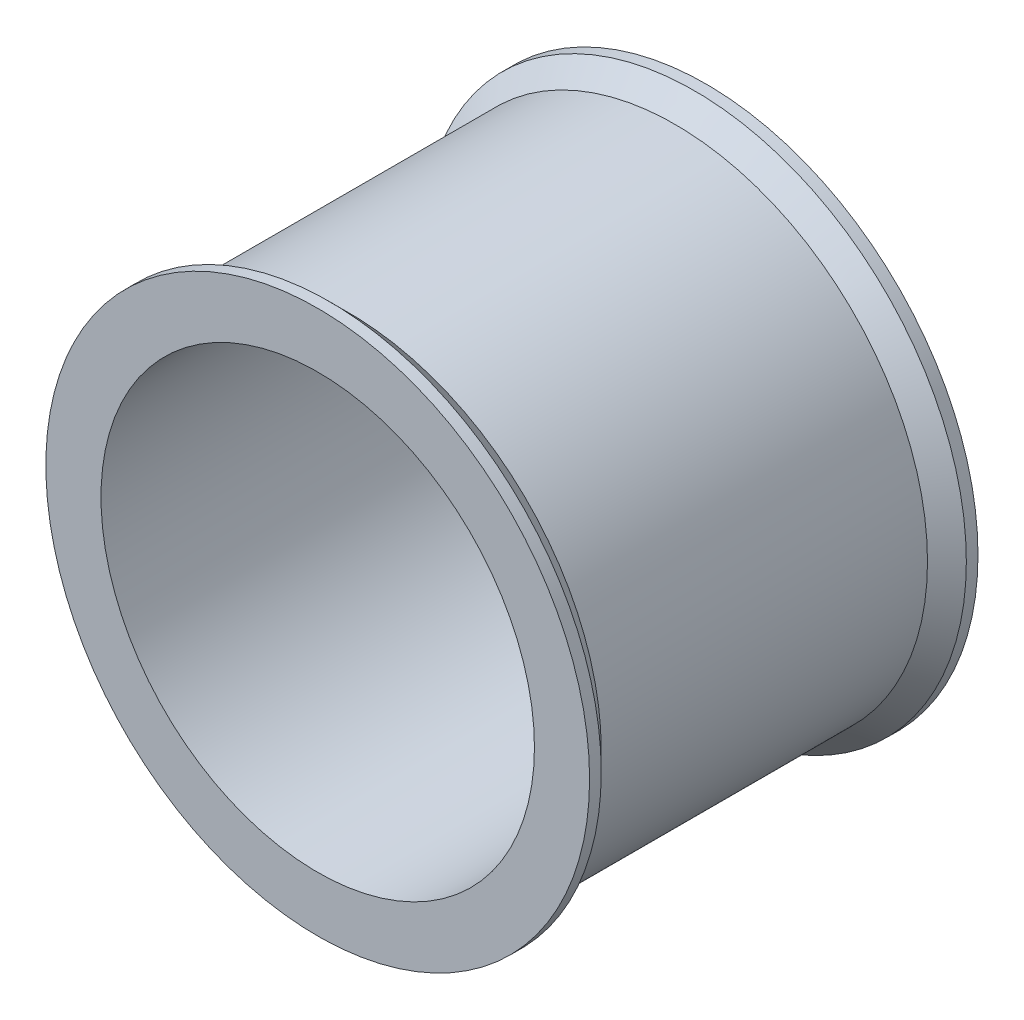
ISO-10303-21;
HEADER;
FILE_DESCRIPTION(('STEP AP214'),'2;1');
FILE_NAME('part.step','',(''),(''),'','','');
FILE_SCHEMA(('AUTOMOTIVE_DESIGN { 1 0 10303 214 1 1 1 1 }'));
ENDSEC;
DATA;
#1=APPLICATION_CONTEXT('core data for automotive mechanical design processes');
#2=APPLICATION_PROTOCOL_DEFINITION('international standard','automotive_design',2000,#1);
#3=PRODUCT_CONTEXT('',#1,'mechanical');
#4=PRODUCT('Part','Part','',(#3));
#5=PRODUCT_RELATED_PRODUCT_CATEGORY('part','',(#4));
#6=PRODUCT_DEFINITION_FORMATION('','',#4);
#7=PRODUCT_DEFINITION_CONTEXT('part definition',#1,'design');
#8=PRODUCT_DEFINITION('design','',#6,#7);
#9=PRODUCT_DEFINITION_SHAPE('','',#8);
#10=(LENGTH_UNIT() NAMED_UNIT(*) SI_UNIT(.MILLI.,.METRE.));
#11=(NAMED_UNIT(*) PLANE_ANGLE_UNIT() SI_UNIT($,.RADIAN.));
#12=(NAMED_UNIT(*) SI_UNIT($,.STERADIAN.) SOLID_ANGLE_UNIT());
#13=UNCERTAINTY_MEASURE_WITH_UNIT(LENGTH_MEASURE(1.E-05),#10,'distance_accuracy_value','');
#14=(GEOMETRIC_REPRESENTATION_CONTEXT(3) GLOBAL_UNCERTAINTY_ASSIGNED_CONTEXT((#13)) GLOBAL_UNIT_ASSIGNED_CONTEXT((#10,
#11,#12)) REPRESENTATION_CONTEXT('',''));
#15=CARTESIAN_POINT('',(0.,0.,0.));
#16=DIRECTION('',(0.,0.,1.));
#17=DIRECTION('',(1.,0.,0.));
#18=AXIS2_PLACEMENT_3D('',#15,#16,#17);
#19=CARTESIAN_POINT('',(0.,0.,5.));
#20=DIRECTION('',(0.,0.,1.));
#21=DIRECTION('',(1.,0.,0.));
#22=AXIS2_PLACEMENT_3D('',#19,#20,#21);
#23=PLANE('',#22);
#24=CARTESIAN_POINT('',(0.,0.,5.));
#25=DIRECTION('',(0.,0.,1.));
#26=DIRECTION('',(1.,0.,0.));
#27=AXIS2_PLACEMENT_3D('',#24,#25,#26);
#28=CIRCLE('',#27,5.58);
#29=CARTESIAN_POINT('',(5.58,0.,5.));
#30=VERTEX_POINT('',#29);
#31=EDGE_CURVE('E64',#30,#30,#28,.T.);
#32=ORIENTED_EDGE('',*,*,#31,.F.);
#33=EDGE_LOOP('',(#32));
#34=FACE_BOUND('',#33,.T.);
#35=CARTESIAN_POINT('',(0.,0.,5.));
#36=DIRECTION('',(0.,0.,1.));
#37=DIRECTION('',(1.,0.,0.));
#38=AXIS2_PLACEMENT_3D('',#35,#36,#37);
#39=CIRCLE('',#38,7.);
#40=CARTESIAN_POINT('',(7.,0.,5.));
#41=VERTEX_POINT('',#40);
#42=EDGE_CURVE('E76',#41,#41,#39,.T.);
#43=ORIENTED_EDGE('',*,*,#42,.T.);
#44=EDGE_LOOP('',(#43));
#45=FACE_BOUND('',#44,.T.);
#46=ADVANCED_FACE('F39',(#34,#45),#23,.T.);
#47=CARTESIAN_POINT('',(0.,0.,-5.));
#48=DIRECTION('',(0.,0.,1.));
#49=DIRECTION('',(1.,0.,0.));
#50=AXIS2_PLACEMENT_3D('',#47,#48,#49);
#51=PLANE('',#50);
#52=CARTESIAN_POINT('',(0.,0.,-5.));
#53=DIRECTION('',(0.,0.,1.));
#54=DIRECTION('',(1.,0.,0.));
#55=AXIS2_PLACEMENT_3D('',#52,#53,#54);
#56=CIRCLE('',#55,5.58);
#57=CARTESIAN_POINT('',(5.58,0.,-5.));
#58=VERTEX_POINT('',#57);
#59=EDGE_CURVE('E65',#58,#58,#56,.T.);
#60=ORIENTED_EDGE('',*,*,#59,.T.);
#61=EDGE_LOOP('',(#60));
#62=FACE_BOUND('',#61,.T.);
#63=CARTESIAN_POINT('',(0.,0.,-5.));
#64=DIRECTION('',(0.,0.,1.));
#65=DIRECTION('',(1.,0.,0.));
#66=AXIS2_PLACEMENT_3D('',#63,#64,#65);
#67=CIRCLE('',#66,7.);
#68=CARTESIAN_POINT('',(7.,0.,-5.));
#69=VERTEX_POINT('',#68);
#70=EDGE_CURVE('E69',#69,#69,#67,.T.);
#71=ORIENTED_EDGE('',*,*,#70,.F.);
#72=EDGE_LOOP('',(#71));
#73=FACE_BOUND('',#72,.T.);
#74=ADVANCED_FACE('F97',(#62,#73),#51,.F.);
#75=CARTESIAN_POINT('',(0.,0.,5.));
#76=DIRECTION('',(0.,0.,-1.));
#77=DIRECTION('',(-1.,0.,0.));
#78=AXIS2_PLACEMENT_3D('',#75,#76,#77);
#79=CYLINDRICAL_SURFACE('',#78,6.5);
#80=CARTESIAN_POINT('',(0.,0.,-4.20000000000001));
#81=DIRECTION('',(0.,0.,-1.));
#82=DIRECTION('',(-1.,0.,0.));
#83=AXIS2_PLACEMENT_3D('',#80,#81,#82);
#84=CIRCLE('',#83,6.5);
#85=CARTESIAN_POINT('',(-6.5,0.,-4.20000000000001));
#86=VERTEX_POINT('',#85);
#87=EDGE_CURVE('E10',#86,#86,#84,.F.);
#88=ORIENTED_EDGE('',*,*,#87,.T.);
#89=EDGE_LOOP('',(#88));
#90=FACE_BOUND('',#89,.T.);
#91=CARTESIAN_POINT('',(0.,0.,4.20000000000001));
#92=DIRECTION('',(0.,0.,1.));
#93=DIRECTION('',(1.,0.,0.));
#94=AXIS2_PLACEMENT_3D('',#91,#92,#93);
#95=CIRCLE('',#94,6.5);
#96=CARTESIAN_POINT('',(6.5,0.,4.20000000000001));
#97=VERTEX_POINT('',#96);
#98=EDGE_CURVE('E48',#97,#97,#95,.F.);
#99=ORIENTED_EDGE('',*,*,#98,.T.);
#100=EDGE_LOOP('',(#99));
#101=FACE_BOUND('',#100,.T.);
#102=ADVANCED_FACE('F103',(#90,#101),#79,.T.);
#103=CARTESIAN_POINT('',(0.,0.,5.));
#104=DIRECTION('',(0.,0.,-1.));
#105=DIRECTION('',(-1.,0.,0.));
#106=AXIS2_PLACEMENT_3D('',#103,#104,#105);
#107=CYLINDRICAL_SURFACE('',#106,5.58);
#108=ORIENTED_EDGE('',*,*,#31,.T.);
#109=EDGE_LOOP('',(#108));
#110=FACE_BOUND('',#109,.T.);
#111=ORIENTED_EDGE('',*,*,#59,.F.);
#112=EDGE_LOOP('',(#111));
#113=FACE_BOUND('',#112,.T.);
#114=ADVANCED_FACE('F93',(#110,#113),#107,.F.);
#115=CARTESIAN_POINT('',(0.,0.,-4.));
#116=DIRECTION('',(0.,0.,-1.));
#117=DIRECTION('',(-1.,0.,0.));
#118=AXIS2_PLACEMENT_3D('',#115,#116,#117);
#119=CYLINDRICAL_SURFACE('',#118,7.);
#120=CARTESIAN_POINT('',(0.,0.,-4.70000000000001));
#121=DIRECTION('',(0.,0.,1.));
#122=DIRECTION('',(1.,0.,0.));
#123=AXIS2_PLACEMENT_3D('',#120,#121,#122);
#124=CIRCLE('',#123,7.);
#125=CARTESIAN_POINT('',(7.,0.,-4.70000000000001));
#126=VERTEX_POINT('',#125);
#127=EDGE_CURVE('E53',#126,#126,#124,.F.);
#128=ORIENTED_EDGE('',*,*,#127,.T.);
#129=EDGE_LOOP('',(#128));
#130=FACE_BOUND('',#129,.T.);
#131=ORIENTED_EDGE('',*,*,#70,.T.);
#132=EDGE_LOOP('',(#131));
#133=FACE_BOUND('',#132,.T.);
#134=ADVANCED_FACE('F85',(#130,#133),#119,.T.);
#135=CARTESIAN_POINT('',(0.,0.,4.));
#136=DIRECTION('',(0.,0.,1.));
#137=DIRECTION('',(1.,0.,0.));
#138=AXIS2_PLACEMENT_3D('',#135,#136,#137);
#139=CYLINDRICAL_SURFACE('',#138,7.);
#140=CARTESIAN_POINT('',(0.,0.,4.70000000000001));
#141=DIRECTION('',(0.,0.,-1.));
#142=DIRECTION('',(-1.,0.,0.));
#143=AXIS2_PLACEMENT_3D('',#140,#141,#142);
#144=CIRCLE('',#143,7.);
#145=CARTESIAN_POINT('',(-7.,0.,4.70000000000001));
#146=VERTEX_POINT('',#145);
#147=EDGE_CURVE('E58',#146,#146,#144,.F.);
#148=ORIENTED_EDGE('',*,*,#147,.T.);
#149=EDGE_LOOP('',(#148));
#150=FACE_BOUND('',#149,.T.);
#151=ORIENTED_EDGE('',*,*,#42,.F.);
#152=EDGE_LOOP('',(#151));
#153=FACE_BOUND('',#152,.T.);
#154=ADVANCED_FACE('F82',(#150,#153),#139,.T.);
#155=CARTESIAN_POINT('',(0.,0.,4.70000000000001));
#156=DIRECTION('',(0.,0.,1.));
#157=DIRECTION('',(1.,0.,0.));
#158=AXIS2_PLACEMENT_3D('',#155,#156,#157);
#159=CONICAL_SURFACE('',#158,7.,0.785398163397443);
#160=ORIENTED_EDGE('',*,*,#98,.F.);
#161=EDGE_LOOP('',(#160));
#162=FACE_BOUND('',#161,.T.);
#163=ORIENTED_EDGE('',*,*,#147,.F.);
#164=EDGE_LOOP('',(#163));
#165=FACE_BOUND('',#164,.T.);
#166=ADVANCED_FACE('F84',(#162,#165),#159,.T.);
#167=CARTESIAN_POINT('',(0.,0.,-4.));
#168=DIRECTION('',(0.,0.,-1.));
#169=DIRECTION('',(-1.,0.,0.));
#170=AXIS2_PLACEMENT_3D('',#167,#168,#169);
#171=CONICAL_SURFACE('',#170,6.29999999999999,0.785398163397453);
#172=ORIENTED_EDGE('',*,*,#127,.F.);
#173=EDGE_LOOP('',(#172));
#174=FACE_BOUND('',#173,.T.);
#175=ORIENTED_EDGE('',*,*,#87,.F.);
#176=EDGE_LOOP('',(#175));
#177=FACE_BOUND('',#176,.T.);
#178=ADVANCED_FACE('F42',(#174,#177),#171,.T.);
#179=CLOSED_SHELL('',(#46,#74,#102,#114,#134,#154,#166,#178));
#180=MANIFOLD_SOLID_BREP('B2',#179);
#181=ADVANCED_BREP_SHAPE_REPRESENTATION('',(#18,#180),#14);
#182=SHAPE_DEFINITION_REPRESENTATION(#9,#181);
ENDSEC;
END-ISO-10303-21;
